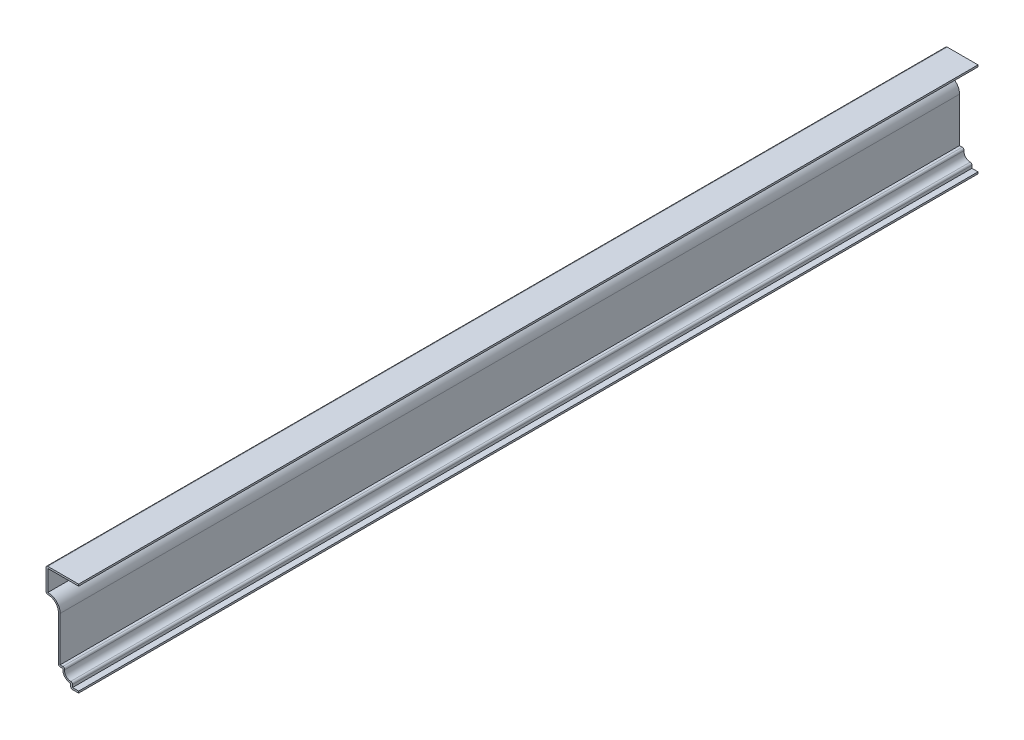
ISO-10303-21;
HEADER;
FILE_DESCRIPTION(('STEP AP214'),'2;1');
FILE_NAME('part.step','',(''),(''),'','','');
FILE_SCHEMA(('AUTOMOTIVE_DESIGN { 1 0 10303 214 1 1 1 1 }'));
ENDSEC;
DATA;
#1=APPLICATION_CONTEXT('core data for automotive mechanical design processes');
#2=APPLICATION_PROTOCOL_DEFINITION('international standard','automotive_design',2000,#1);
#3=PRODUCT_CONTEXT('',#1,'mechanical');
#4=PRODUCT('Part','Part','',(#3));
#5=PRODUCT_RELATED_PRODUCT_CATEGORY('part','',(#4));
#6=PRODUCT_DEFINITION_FORMATION('','',#4);
#7=PRODUCT_DEFINITION_CONTEXT('part definition',#1,'design');
#8=PRODUCT_DEFINITION('design','',#6,#7);
#9=PRODUCT_DEFINITION_SHAPE('','',#8);
#10=(LENGTH_UNIT() NAMED_UNIT(*) SI_UNIT(.MILLI.,.METRE.));
#11=(NAMED_UNIT(*) PLANE_ANGLE_UNIT() SI_UNIT($,.RADIAN.));
#12=(NAMED_UNIT(*) SI_UNIT($,.STERADIAN.) SOLID_ANGLE_UNIT());
#13=UNCERTAINTY_MEASURE_WITH_UNIT(LENGTH_MEASURE(1.E-05),#10,'distance_accuracy_value','');
#14=(GEOMETRIC_REPRESENTATION_CONTEXT(3) GLOBAL_UNCERTAINTY_ASSIGNED_CONTEXT((#13)) GLOBAL_UNIT_ASSIGNED_CONTEXT((#10,
#11,#12)) REPRESENTATION_CONTEXT('',''));
#15=CARTESIAN_POINT('',(0.,0.,0.));
#16=DIRECTION('',(0.,0.,1.));
#17=DIRECTION('',(1.,0.,0.));
#18=AXIS2_PLACEMENT_3D('',#15,#16,#17);
#19=CARTESIAN_POINT('',(-23.01875,65.405,-635.));
#20=DIRECTION('',(0.,-1.,0.));
#21=DIRECTION('',(0.,0.,-1.));
#22=AXIS2_PLACEMENT_3D('',#19,#20,#21);
#23=PLANE('',#22);
#24=DIRECTION('',(1.,0.,0.));
#25=VECTOR('',#24,1.);
#26=CARTESIAN_POINT('',(-23.01875,65.405,0.));
#27=LINE('',#26,#25);
#28=CARTESIAN_POINT('',(-21.74875,65.405,0.));
#29=VERTEX_POINT('',#28);
#30=CARTESIAN_POINT('',(0.,65.405,0.));
#31=VERTEX_POINT('',#30);
#32=EDGE_CURVE('E265',#29,#31,#27,.T.);
#33=ORIENTED_EDGE('',*,*,#32,.F.);
#34=DIRECTION('',(0.,0.,1.));
#35=VECTOR('',#34,1.);
#36=CARTESIAN_POINT('',(-21.74875,65.405,-635.));
#37=LINE('',#36,#35);
#38=CARTESIAN_POINT('',(-21.74875,65.405,-635.));
#39=VERTEX_POINT('',#38);
#40=EDGE_CURVE('E220',#39,#29,#37,.T.);
#41=ORIENTED_EDGE('',*,*,#40,.F.);
#42=DIRECTION('',(1.,0.,0.));
#43=VECTOR('',#42,1.);
#44=CARTESIAN_POINT('',(-23.01875,65.405,-635.));
#45=LINE('',#44,#43);
#46=CARTESIAN_POINT('',(0.,65.405,-635.));
#47=VERTEX_POINT('',#46);
#48=EDGE_CURVE('E202',#39,#47,#45,.T.);
#49=ORIENTED_EDGE('',*,*,#48,.T.);
#50=DIRECTION('',(0.,0.,1.));
#51=VECTOR('',#50,1.);
#52=CARTESIAN_POINT('',(0.,65.405,-635.));
#53=LINE('',#52,#51);
#54=EDGE_CURVE('E210',#47,#31,#53,.T.);
#55=ORIENTED_EDGE('',*,*,#54,.T.);
#56=EDGE_LOOP('',(#33,#41,#49,#55));
#57=FACE_BOUND('',#56,.T.);
#58=ADVANCED_FACE('F35',(#57),#23,.T.);
#59=CARTESIAN_POINT('',(-21.74875,49.2125,-635.));
#60=DIRECTION('',(1.,0.,0.));
#61=DIRECTION('',(0.,1.,0.));
#62=AXIS2_PLACEMENT_3D('',#59,#60,#61);
#63=PLANE('',#62);
#64=DIRECTION('',(0.,1.,0.));
#65=VECTOR('',#64,1.);
#66=CARTESIAN_POINT('',(-21.74875,49.2125,0.));
#67=LINE('',#66,#65);
#68=CARTESIAN_POINT('',(-21.74875,50.655129317317,0.));
#69=VERTEX_POINT('',#68);
#70=EDGE_CURVE('E221',#69,#29,#67,.T.);
#71=ORIENTED_EDGE('',*,*,#70,.F.);
#72=DIRECTION('',(0.,0.,1.));
#73=VECTOR('',#72,1.);
#74=CARTESIAN_POINT('',(-21.74875,50.655129317317,-635.));
#75=LINE('',#74,#73);
#76=CARTESIAN_POINT('',(-21.74875,50.655129317317,-635.));
#77=VERTEX_POINT('',#76);
#78=EDGE_CURVE('E307',#77,#69,#75,.T.);
#79=ORIENTED_EDGE('',*,*,#78,.F.);
#80=DIRECTION('',(0.,1.,0.));
#81=VECTOR('',#80,1.);
#82=CARTESIAN_POINT('',(-21.74875,49.2125,-635.));
#83=LINE('',#82,#81);
#84=EDGE_CURVE('E218',#77,#39,#83,.T.);
#85=ORIENTED_EDGE('',*,*,#84,.T.);
#86=ORIENTED_EDGE('',*,*,#40,.T.);
#87=EDGE_LOOP('',(#71,#79,#85,#86));
#88=FACE_BOUND('',#87,.T.);
#89=ADVANCED_FACE('F427',(#88),#63,.T.);
#90=CARTESIAN_POINT('',(-21.43125,42.2473720175075,-635.));
#91=DIRECTION('',(0.,0.,1.));
#92=DIRECTION('',(1.,0.,0.));
#93=AXIS2_PLACEMENT_3D('',#90,#91,#92);
#94=CYLINDRICAL_SURFACE('',#93,8.41375);
#95=CARTESIAN_POINT('',(-21.43125,42.2473720175075,0.));
#96=DIRECTION('',(0.,0.,1.));
#97=DIRECTION('',(1.,0.,0.));
#98=AXIS2_PLACEMENT_3D('',#95,#96,#97);
#99=CIRCLE('',#98,8.41375);
#100=CARTESIAN_POINT('',(-13.0175,42.2473720175075,0.));
#101=VERTEX_POINT('',#100);
#102=EDGE_CURVE('E224',#101,#69,#99,.T.);
#103=ORIENTED_EDGE('',*,*,#102,.F.);
#104=DIRECTION('',(0.,0.,1.));
#105=VECTOR('',#104,1.);
#106=CARTESIAN_POINT('',(-13.0175,42.2473720175075,-635.));
#107=LINE('',#106,#105);
#108=CARTESIAN_POINT('',(-13.0175,42.2473720175075,-635.));
#109=VERTEX_POINT('',#108);
#110=EDGE_CURVE('E309',#109,#101,#107,.T.);
#111=ORIENTED_EDGE('',*,*,#110,.F.);
#112=CARTESIAN_POINT('',(-21.43125,42.2473720175075,-635.));
#113=DIRECTION('',(0.,0.,1.));
#114=DIRECTION('',(1.,0.,0.));
#115=AXIS2_PLACEMENT_3D('',#112,#113,#114);
#116=CIRCLE('',#115,8.41375);
#117=EDGE_CURVE('E261',#109,#77,#116,.T.);
#118=ORIENTED_EDGE('',*,*,#117,.T.);
#119=ORIENTED_EDGE('',*,*,#78,.T.);
#120=EDGE_LOOP('',(#103,#111,#118,#119));
#121=FACE_BOUND('',#120,.T.);
#122=ADVANCED_FACE('F482',(#121),#94,.T.);
#123=CARTESIAN_POINT('',(-13.0175,9.525,-635.));
#124=DIRECTION('',(1.,0.,0.));
#125=DIRECTION('',(0.,1.,0.));
#126=AXIS2_PLACEMENT_3D('',#123,#124,#125);
#127=PLANE('',#126);
#128=DIRECTION('',(0.,1.,0.));
#129=VECTOR('',#128,1.);
#130=CARTESIAN_POINT('',(-13.0175,9.525,0.));
#131=LINE('',#130,#129);
#132=CARTESIAN_POINT('',(-13.0175,10.795,0.));
#133=VERTEX_POINT('',#132);
#134=EDGE_CURVE('E300',#133,#101,#131,.T.);
#135=ORIENTED_EDGE('',*,*,#134,.F.);
#136=DIRECTION('',(0.,0.,1.));
#137=VECTOR('',#136,1.);
#138=CARTESIAN_POINT('',(-13.0175,10.795,-635.));
#139=LINE('',#138,#137);
#140=CARTESIAN_POINT('',(-13.0175,10.795,-635.));
#141=VERTEX_POINT('',#140);
#142=EDGE_CURVE('E311',#141,#133,#139,.T.);
#143=ORIENTED_EDGE('',*,*,#142,.F.);
#144=DIRECTION('',(0.,1.,0.));
#145=VECTOR('',#144,1.);
#146=CARTESIAN_POINT('',(-13.0175,9.525,-635.));
#147=LINE('',#146,#145);
#148=EDGE_CURVE('E258',#141,#109,#147,.T.);
#149=ORIENTED_EDGE('',*,*,#148,.T.);
#150=ORIENTED_EDGE('',*,*,#110,.T.);
#151=EDGE_LOOP('',(#135,#143,#149,#150));
#152=FACE_BOUND('',#151,.T.);
#153=ADVANCED_FACE('F435',(#152),#127,.T.);
#154=CARTESIAN_POINT('',(-11.1125,10.795,-635.));
#155=DIRECTION('',(0.,1.,0.));
#156=DIRECTION('',(-1.,0.,0.));
#157=AXIS2_PLACEMENT_3D('',#154,#155,#156);
#158=PLANE('',#157);
#159=DIRECTION('',(-1.,0.,0.));
#160=VECTOR('',#159,1.);
#161=CARTESIAN_POINT('',(-11.1125,10.795,0.));
#162=LINE('',#161,#160);
#163=CARTESIAN_POINT('',(-11.1125,10.795,0.));
#164=VERTEX_POINT('',#163);
#165=EDGE_CURVE('E298',#164,#133,#162,.T.);
#166=ORIENTED_EDGE('',*,*,#165,.F.);
#167=DIRECTION('',(0.,0.,1.));
#168=VECTOR('',#167,1.);
#169=CARTESIAN_POINT('',(-11.1125,10.795,-635.));
#170=LINE('',#169,#168);
#171=CARTESIAN_POINT('',(-11.1125,10.795,-635.));
#172=VERTEX_POINT('',#171);
#173=EDGE_CURVE('E375',#164,#172,#170,.F.);
#174=ORIENTED_EDGE('',*,*,#173,.T.);
#175=DIRECTION('',(-1.,0.,0.));
#176=VECTOR('',#175,1.);
#177=CARTESIAN_POINT('',(-11.1125,10.795,-635.));
#178=LINE('',#177,#176);
#179=EDGE_CURVE('E256',#172,#141,#178,.T.);
#180=ORIENTED_EDGE('',*,*,#179,.T.);
#181=ORIENTED_EDGE('',*,*,#142,.T.);
#182=EDGE_LOOP('',(#166,#174,#180,#181));
#183=FACE_BOUND('',#182,.T.);
#184=ADVANCED_FACE('F438',(#183),#158,.T.);
#185=CARTESIAN_POINT('',(-5.55625,8.780859375,-635.));
#186=DIRECTION('',(0.,0.,1.));
#187=DIRECTION('',(1.,0.,0.));
#188=AXIS2_PLACEMENT_3D('',#185,#186,#187);
#189=CYLINDRICAL_SURFACE('',#188,4.335859375);
#190=CARTESIAN_POINT('',(-5.55625,8.780859375,0.));
#191=DIRECTION('',(0.,0.,1.));
#192=DIRECTION('',(1.,0.,0.));
#193=AXIS2_PLACEMENT_3D('',#190,#191,#192);
#194=CIRCLE('',#193,4.335859375);
#195=CARTESIAN_POINT('',(-5.55625,4.445,0.));
#196=VERTEX_POINT('',#195);
#197=CARTESIAN_POINT('',(-9.8537389380531,9.35641592920354,0.));
#198=VERTEX_POINT('',#197);
#199=EDGE_CURVE('E295',#196,#198,#194,.F.);
#200=ORIENTED_EDGE('',*,*,#199,.F.);
#201=DIRECTION('',(0.,0.,1.));
#202=VECTOR('',#201,1.);
#203=CARTESIAN_POINT('',(-5.55625,4.445,-635.));
#204=LINE('',#203,#202);
#205=CARTESIAN_POINT('',(-5.55625,4.445,-635.));
#206=VERTEX_POINT('',#205);
#207=EDGE_CURVE('E348',#196,#206,#204,.F.);
#208=ORIENTED_EDGE('',*,*,#207,.T.);
#209=CARTESIAN_POINT('',(-5.55625,8.780859375,-635.));
#210=DIRECTION('',(0.,0.,1.));
#211=DIRECTION('',(1.,0.,0.));
#212=AXIS2_PLACEMENT_3D('',#209,#210,#211);
#213=CIRCLE('',#212,4.335859375);
#214=CARTESIAN_POINT('',(-9.8537389380531,9.35641592920354,-635.));
#215=VERTEX_POINT('',#214);
#216=EDGE_CURVE('E253',#206,#215,#213,.F.);
#217=ORIENTED_EDGE('',*,*,#216,.T.);
#218=DIRECTION('',(0.,0.,1.));
#219=VECTOR('',#218,1.);
#220=CARTESIAN_POINT('',(-9.8537389380531,9.35641592920354,-635.));
#221=LINE('',#220,#219);
#222=EDGE_CURVE('E345',#215,#198,#221,.T.);
#223=ORIENTED_EDGE('',*,*,#222,.T.);
#224=EDGE_LOOP('',(#200,#208,#217,#223));
#225=FACE_BOUND('',#224,.T.);
#226=ADVANCED_FACE('F446',(#225),#189,.F.);
#227=CARTESIAN_POINT('',(-4.28625,0.,-635.));
#228=DIRECTION('',(1.,0.,0.));
#229=DIRECTION('',(0.,0.,-1.));
#230=AXIS2_PLACEMENT_3D('',#227,#228,#229);
#231=PLANE('',#230);
#232=DIRECTION('',(0.,1.,0.));
#233=VECTOR('',#232,1.);
#234=CARTESIAN_POINT('',(-4.28625,0.,-635.));
#235=LINE('',#234,#233);
#236=CARTESIAN_POINT('',(-4.28625,1.27,-635.));
#237=VERTEX_POINT('',#236);
#238=CARTESIAN_POINT('',(-4.28625,3.175,-635.));
#239=VERTEX_POINT('',#238);
#240=EDGE_CURVE('E250',#237,#239,#235,.T.);
#241=ORIENTED_EDGE('',*,*,#240,.T.);
#242=DIRECTION('',(0.,0.,1.));
#243=VECTOR('',#242,1.);
#244=CARTESIAN_POINT('',(-4.28625,3.175,-635.));
#245=LINE('',#244,#243);
#246=CARTESIAN_POINT('',(-4.28625,3.175,0.));
#247=VERTEX_POINT('',#246);
#248=EDGE_CURVE('E306',#239,#247,#245,.T.);
#249=ORIENTED_EDGE('',*,*,#248,.T.);
#250=DIRECTION('',(0.,1.,0.));
#251=VECTOR('',#250,1.);
#252=CARTESIAN_POINT('',(-4.28625,0.,0.));
#253=LINE('',#252,#251);
#254=CARTESIAN_POINT('',(-4.28625,1.27,0.));
#255=VERTEX_POINT('',#254);
#256=EDGE_CURVE('E292',#255,#247,#253,.T.);
#257=ORIENTED_EDGE('',*,*,#256,.F.);
#258=DIRECTION('',(0.,0.,1.));
#259=VECTOR('',#258,1.);
#260=CARTESIAN_POINT('',(-4.28625,1.27,-635.));
#261=LINE('',#260,#259);
#262=EDGE_CURVE('E314',#237,#255,#261,.T.);
#263=ORIENTED_EDGE('',*,*,#262,.F.);
#264=EDGE_LOOP('',(#241,#249,#257,#263));
#265=FACE_BOUND('',#264,.T.);
#266=ADVANCED_FACE('F454',(#265),#231,.T.);
#267=CARTESIAN_POINT('',(0.,1.27,-635.));
#268=DIRECTION('',(0.,1.,0.));
#269=DIRECTION('',(0.,0.,1.));
#270=AXIS2_PLACEMENT_3D('',#267,#268,#269);
#271=PLANE('',#270);
#272=DIRECTION('',(1.,0.,0.));
#273=VECTOR('',#272,1.);
#274=CARTESIAN_POINT('',(0.,1.27,0.));
#275=LINE('',#274,#273);
#276=CARTESIAN_POINT('',(0.,1.27,0.));
#277=VERTEX_POINT('',#276);
#278=EDGE_CURVE('E289',#277,#255,#275,.F.);
#279=ORIENTED_EDGE('',*,*,#278,.F.);
#280=DIRECTION('',(0.,0.,1.));
#281=VECTOR('',#280,1.);
#282=CARTESIAN_POINT('',(0.,1.27,-635.));
#283=LINE('',#282,#281);
#284=CARTESIAN_POINT('',(0.,1.27,-635.));
#285=VERTEX_POINT('',#284);
#286=EDGE_CURVE('E316',#285,#277,#283,.T.);
#287=ORIENTED_EDGE('',*,*,#286,.F.);
#288=DIRECTION('',(1.,0.,0.));
#289=VECTOR('',#288,1.);
#290=CARTESIAN_POINT('',(0.,1.27,-635.));
#291=LINE('',#290,#289);
#292=EDGE_CURVE('E247',#285,#237,#291,.F.);
#293=ORIENTED_EDGE('',*,*,#292,.T.);
#294=ORIENTED_EDGE('',*,*,#262,.T.);
#295=EDGE_LOOP('',(#279,#287,#293,#294));
#296=FACE_BOUND('',#295,.T.);
#297=ADVANCED_FACE('F459',(#296),#271,.T.);
#298=CARTESIAN_POINT('',(0.,1.27,-635.));
#299=DIRECTION('',(-1.,0.,0.));
#300=DIRECTION('',(0.,0.,1.));
#301=AXIS2_PLACEMENT_3D('',#298,#299,#300);
#302=PLANE('',#301);
#303=DIRECTION('',(0.,-1.,0.));
#304=VECTOR('',#303,1.);
#305=CARTESIAN_POINT('',(0.,1.27,0.));
#306=LINE('',#305,#304);
#307=CARTESIAN_POINT('',(0.,0.,0.));
#308=VERTEX_POINT('',#307);
#309=EDGE_CURVE('E287',#277,#308,#306,.T.);
#310=ORIENTED_EDGE('',*,*,#309,.T.);
#311=DIRECTION('',(0.,0.,1.));
#312=VECTOR('',#311,1.);
#313=CARTESIAN_POINT('',(0.,0.,-635.));
#314=LINE('',#313,#312);
#315=CARTESIAN_POINT('',(0.,0.,-635.));
#316=VERTEX_POINT('',#315);
#317=EDGE_CURVE('E318',#316,#308,#314,.T.);
#318=ORIENTED_EDGE('',*,*,#317,.F.);
#319=DIRECTION('',(0.,-1.,0.));
#320=VECTOR('',#319,1.);
#321=CARTESIAN_POINT('',(0.,1.27,-635.));
#322=LINE('',#321,#320);
#323=EDGE_CURVE('E245',#285,#316,#322,.T.);
#324=ORIENTED_EDGE('',*,*,#323,.F.);
#325=ORIENTED_EDGE('',*,*,#286,.T.);
#326=EDGE_LOOP('',(#310,#318,#324,#325));
#327=FACE_BOUND('',#326,.T.);
#328=ADVANCED_FACE('F464',(#327),#302,.F.);
#329=CARTESIAN_POINT('',(0.,0.,-635.));
#330=DIRECTION('',(0.,1.,0.));
#331=DIRECTION('',(0.,0.,1.));
#332=AXIS2_PLACEMENT_3D('',#329,#330,#331);
#333=PLANE('',#332);
#334=DIRECTION('',(-1.,0.,0.));
#335=VECTOR('',#334,1.);
#336=CARTESIAN_POINT('',(0.,0.,0.));
#337=LINE('',#336,#335);
#338=CARTESIAN_POINT('',(-4.28625,0.,0.));
#339=VERTEX_POINT('',#338);
#340=EDGE_CURVE('E284',#308,#339,#337,.T.);
#341=ORIENTED_EDGE('',*,*,#340,.T.);
#342=DIRECTION('',(0.,0.,1.));
#343=VECTOR('',#342,1.);
#344=CARTESIAN_POINT('',(-4.28625,0.,-635.));
#345=LINE('',#344,#343);
#346=CARTESIAN_POINT('',(-4.28625,0.,-635.));
#347=VERTEX_POINT('',#346);
#348=EDGE_CURVE('E11',#339,#347,#345,.F.);
#349=ORIENTED_EDGE('',*,*,#348,.T.);
#350=DIRECTION('',(-1.,0.,0.));
#351=VECTOR('',#350,1.);
#352=CARTESIAN_POINT('',(0.,0.,-635.));
#353=LINE('',#352,#351);
#354=EDGE_CURVE('E242',#316,#347,#353,.T.);
#355=ORIENTED_EDGE('',*,*,#354,.F.);
#356=ORIENTED_EDGE('',*,*,#317,.T.);
#357=EDGE_LOOP('',(#341,#349,#355,#356));
#358=FACE_BOUND('',#357,.T.);
#359=ADVANCED_FACE('F468',(#358),#333,.F.);
#360=CARTESIAN_POINT('',(-5.55625,0.,-635.));
#361=DIRECTION('',(1.,0.,0.));
#362=DIRECTION('',(0.,0.,-1.));
#363=AXIS2_PLACEMENT_3D('',#360,#361,#362);
#364=PLANE('',#363);
#365=DIRECTION('',(0.,1.,0.));
#366=VECTOR('',#365,1.);
#367=CARTESIAN_POINT('',(-5.55625,0.,-635.));
#368=LINE('',#367,#366);
#369=CARTESIAN_POINT('',(-5.55625,1.27,-635.));
#370=VERTEX_POINT('',#369);
#371=CARTESIAN_POINT('',(-5.55625,3.175,-635.));
#372=VERTEX_POINT('',#371);
#373=EDGE_CURVE('E240',#370,#372,#368,.T.);
#374=ORIENTED_EDGE('',*,*,#373,.F.);
#375=DIRECTION('',(0.,0.,1.));
#376=VECTOR('',#375,1.);
#377=CARTESIAN_POINT('',(-5.55625,1.27,-635.));
#378=LINE('',#377,#376);
#379=CARTESIAN_POINT('',(-5.55625,1.27,0.));
#380=VERTEX_POINT('',#379);
#381=EDGE_CURVE('E43',#370,#380,#378,.T.);
#382=ORIENTED_EDGE('',*,*,#381,.T.);
#383=DIRECTION('',(0.,1.,0.));
#384=VECTOR('',#383,1.);
#385=CARTESIAN_POINT('',(-5.55625,0.,0.));
#386=LINE('',#385,#384);
#387=CARTESIAN_POINT('',(-5.55625,3.175,0.));
#388=VERTEX_POINT('',#387);
#389=EDGE_CURVE('E282',#380,#388,#386,.T.);
#390=ORIENTED_EDGE('',*,*,#389,.T.);
#391=DIRECTION('',(0.,0.,1.));
#392=VECTOR('',#391,1.);
#393=CARTESIAN_POINT('',(-5.55625,3.175,-635.));
#394=LINE('',#393,#392);
#395=EDGE_CURVE('E321',#372,#388,#394,.T.);
#396=ORIENTED_EDGE('',*,*,#395,.F.);
#397=EDGE_LOOP('',(#374,#382,#390,#396));
#398=FACE_BOUND('',#397,.T.);
#399=ADVANCED_FACE('F381',(#398),#364,.F.);
#400=CARTESIAN_POINT('',(-5.55625,8.780859375,-635.));
#401=DIRECTION('',(0.,0.,1.));
#402=DIRECTION('',(1.,0.,0.));
#403=AXIS2_PLACEMENT_3D('',#400,#401,#402);
#404=CYLINDRICAL_SURFACE('',#403,5.605859375);
#405=CARTESIAN_POINT('',(-5.55625,8.780859375,0.));
#406=DIRECTION('',(0.,0.,-1.));
#407=DIRECTION('',(-1.,0.,0.));
#408=AXIS2_PLACEMENT_3D('',#405,#406,#407);
#409=CIRCLE('',#408,5.605859375);
#410=CARTESIAN_POINT('',(-11.1125,9.525,0.));
#411=VERTEX_POINT('',#410);
#412=EDGE_CURVE('E280',#388,#411,#409,.T.);
#413=ORIENTED_EDGE('',*,*,#412,.T.);
#414=DIRECTION('',(0.,0.,1.));
#415=VECTOR('',#414,1.);
#416=CARTESIAN_POINT('',(-11.1125,9.525,-635.));
#417=LINE('',#416,#415);
#418=CARTESIAN_POINT('',(-11.1125,9.525,-635.));
#419=VERTEX_POINT('',#418);
#420=EDGE_CURVE('E324',#419,#411,#417,.T.);
#421=ORIENTED_EDGE('',*,*,#420,.F.);
#422=CARTESIAN_POINT('',(-5.55625,8.780859375,-635.));
#423=DIRECTION('',(0.,0.,-1.));
#424=DIRECTION('',(-1.,0.,0.));
#425=AXIS2_PLACEMENT_3D('',#422,#423,#424);
#426=CIRCLE('',#425,5.605859375);
#427=EDGE_CURVE('E238',#372,#419,#426,.T.);
#428=ORIENTED_EDGE('',*,*,#427,.F.);
#429=ORIENTED_EDGE('',*,*,#395,.T.);
#430=EDGE_LOOP('',(#413,#421,#428,#429));
#431=FACE_BOUND('',#430,.T.);
#432=ADVANCED_FACE('F392',(#431),#404,.T.);
#433=CARTESIAN_POINT('',(-11.1125,9.525,-635.));
#434=DIRECTION('',(0.,1.,0.));
#435=DIRECTION('',(-1.,0.,0.));
#436=AXIS2_PLACEMENT_3D('',#433,#434,#435);
#437=PLANE('',#436);
#438=DIRECTION('',(-1.,0.,0.));
#439=VECTOR('',#438,1.);
#440=CARTESIAN_POINT('',(-11.1125,9.525,0.));
#441=LINE('',#440,#439);
#442=CARTESIAN_POINT('',(-13.0175,9.525,0.));
#443=VERTEX_POINT('',#442);
#444=EDGE_CURVE('E277',#411,#443,#441,.T.);
#445=ORIENTED_EDGE('',*,*,#444,.T.);
#446=DIRECTION('',(0.,0.,1.));
#447=VECTOR('',#446,1.);
#448=CARTESIAN_POINT('',(-13.0175,9.525,-635.));
#449=LINE('',#448,#447);
#450=CARTESIAN_POINT('',(-13.0175,9.525,-635.));
#451=VERTEX_POINT('',#450);
#452=EDGE_CURVE('E373',#443,#451,#449,.F.);
#453=ORIENTED_EDGE('',*,*,#452,.T.);
#454=DIRECTION('',(-1.,0.,0.));
#455=VECTOR('',#454,1.);
#456=CARTESIAN_POINT('',(-11.1125,9.525,-635.));
#457=LINE('',#456,#455);
#458=EDGE_CURVE('E235',#419,#451,#457,.T.);
#459=ORIENTED_EDGE('',*,*,#458,.F.);
#460=ORIENTED_EDGE('',*,*,#420,.T.);
#461=EDGE_LOOP('',(#445,#453,#459,#460));
#462=FACE_BOUND('',#461,.T.);
#463=ADVANCED_FACE('F396',(#462),#437,.F.);
#464=CARTESIAN_POINT('',(-14.2875,9.525,-635.));
#465=DIRECTION('',(1.,0.,0.));
#466=DIRECTION('',(0.,1.,0.));
#467=AXIS2_PLACEMENT_3D('',#464,#465,#466);
#468=PLANE('',#467);
#469=DIRECTION('',(0.,1.,0.));
#470=VECTOR('',#469,1.);
#471=CARTESIAN_POINT('',(-14.2875,9.525,-635.));
#472=LINE('',#471,#470);
#473=CARTESIAN_POINT('',(-14.2875,10.795,-635.));
#474=VERTEX_POINT('',#473);
#475=CARTESIAN_POINT('',(-14.2875,42.2473720175075,-635.));
#476=VERTEX_POINT('',#475);
#477=EDGE_CURVE('E233',#474,#476,#472,.T.);
#478=ORIENTED_EDGE('',*,*,#477,.F.);
#479=DIRECTION('',(0.,0.,1.));
#480=VECTOR('',#479,1.);
#481=CARTESIAN_POINT('',(-14.2875,10.795,-635.));
#482=LINE('',#481,#480);
#483=CARTESIAN_POINT('',(-14.2875,10.795,0.));
#484=VERTEX_POINT('',#483);
#485=EDGE_CURVE('E370',#474,#484,#482,.T.);
#486=ORIENTED_EDGE('',*,*,#485,.T.);
#487=DIRECTION('',(0.,1.,0.));
#488=VECTOR('',#487,1.);
#489=CARTESIAN_POINT('',(-14.2875,9.525,0.));
#490=LINE('',#489,#488);
#491=CARTESIAN_POINT('',(-14.2875,42.2473720175075,0.));
#492=VERTEX_POINT('',#491);
#493=EDGE_CURVE('E275',#484,#492,#490,.T.);
#494=ORIENTED_EDGE('',*,*,#493,.T.);
#495=DIRECTION('',(0.,0.,1.));
#496=VECTOR('',#495,1.);
#497=CARTESIAN_POINT('',(-14.2875,42.2473720175075,-635.));
#498=LINE('',#497,#496);
#499=EDGE_CURVE('E327',#476,#492,#498,.T.);
#500=ORIENTED_EDGE('',*,*,#499,.F.);
#501=EDGE_LOOP('',(#478,#486,#494,#500));
#502=FACE_BOUND('',#501,.T.);
#503=ADVANCED_FACE('F405',(#502),#468,.F.);
#504=CARTESIAN_POINT('',(-21.43125,42.2473720175075,-635.));
#505=DIRECTION('',(0.,0.,1.));
#506=DIRECTION('',(1.,0.,0.));
#507=AXIS2_PLACEMENT_3D('',#504,#505,#506);
#508=CYLINDRICAL_SURFACE('',#507,7.14375);
#509=CARTESIAN_POINT('',(-21.43125,42.2473720175075,0.));
#510=DIRECTION('',(0.,0.,1.));
#511=DIRECTION('',(1.,0.,0.));
#512=AXIS2_PLACEMENT_3D('',#509,#510,#511);
#513=CIRCLE('',#512,7.14375);
#514=CARTESIAN_POINT('',(-21.7008254716981,49.3860338758363,0.));
#515=VERTEX_POINT('',#514);
#516=EDGE_CURVE('E272',#492,#515,#513,.T.);
#517=ORIENTED_EDGE('',*,*,#516,.T.);
#518=DIRECTION('',(0.,0.,1.));
#519=VECTOR('',#518,1.);
#520=CARTESIAN_POINT('',(-21.7008254716981,49.3860338758363,-635.));
#521=LINE('',#520,#519);
#522=CARTESIAN_POINT('',(-21.7008254716981,49.3860338758363,-635.));
#523=VERTEX_POINT('',#522);
#524=EDGE_CURVE('E368',#515,#523,#521,.F.);
#525=ORIENTED_EDGE('',*,*,#524,.T.);
#526=CARTESIAN_POINT('',(-21.43125,42.2473720175075,-635.));
#527=DIRECTION('',(0.,0.,1.));
#528=DIRECTION('',(1.,0.,0.));
#529=AXIS2_PLACEMENT_3D('',#526,#527,#528);
#530=CIRCLE('',#529,7.14375);
#531=EDGE_CURVE('E230',#476,#523,#530,.T.);
#532=ORIENTED_EDGE('',*,*,#531,.F.);
#533=ORIENTED_EDGE('',*,*,#499,.T.);
#534=EDGE_LOOP('',(#517,#525,#532,#533));
#535=FACE_BOUND('',#534,.T.);
#536=ADVANCED_FACE('F411',(#535),#508,.F.);
#537=CARTESIAN_POINT('',(-23.01875,49.2125,-635.));
#538=DIRECTION('',(1.,0.,0.));
#539=DIRECTION('',(0.,1.,0.));
#540=AXIS2_PLACEMENT_3D('',#537,#538,#539);
#541=PLANE('',#540);
#542=DIRECTION('',(0.,1.,0.));
#543=VECTOR('',#542,1.);
#544=CARTESIAN_POINT('',(-23.01875,49.2125,0.));
#545=LINE('',#544,#543);
#546=CARTESIAN_POINT('',(-23.01875,50.655129317317,0.));
#547=VERTEX_POINT('',#546);
#548=CARTESIAN_POINT('',(-23.01875,65.405,0.));
#549=VERTEX_POINT('',#548);
#550=EDGE_CURVE('E270',#547,#549,#545,.T.);
#551=ORIENTED_EDGE('',*,*,#550,.T.);
#552=DIRECTION('',(0.,0.,1.));
#553=VECTOR('',#552,1.);
#554=CARTESIAN_POINT('',(-23.01875,65.405,-635.));
#555=LINE('',#554,#553);
#556=CARTESIAN_POINT('',(-23.01875,65.405,-635.));
#557=VERTEX_POINT('',#556);
#558=EDGE_CURVE('E58',#549,#557,#555,.F.);
#559=ORIENTED_EDGE('',*,*,#558,.T.);
#560=DIRECTION('',(0.,1.,0.));
#561=VECTOR('',#560,1.);
#562=CARTESIAN_POINT('',(-23.01875,49.2125,-635.));
#563=LINE('',#562,#561);
#564=CARTESIAN_POINT('',(-23.01875,50.655129317317,-635.));
#565=VERTEX_POINT('',#564);
#566=EDGE_CURVE('E228',#565,#557,#563,.T.);
#567=ORIENTED_EDGE('',*,*,#566,.F.);
#568=DIRECTION('',(0.,0.,1.));
#569=VECTOR('',#568,1.);
#570=CARTESIAN_POINT('',(-23.01875,50.655129317317,-635.));
#571=LINE('',#570,#569);
#572=EDGE_CURVE('E364',#565,#547,#571,.T.);
#573=ORIENTED_EDGE('',*,*,#572,.T.);
#574=EDGE_LOOP('',(#551,#559,#567,#573));
#575=FACE_BOUND('',#574,.T.);
#576=ADVANCED_FACE('F417',(#575),#541,.F.);
#577=CARTESIAN_POINT('',(-23.01875,66.675,-635.));
#578=DIRECTION('',(0.,-1.,0.));
#579=DIRECTION('',(0.,0.,-1.));
#580=AXIS2_PLACEMENT_3D('',#577,#578,#579);
#581=PLANE('',#580);
#582=DIRECTION('',(1.,0.,0.));
#583=VECTOR('',#582,1.);
#584=CARTESIAN_POINT('',(-23.01875,66.675,-635.));
#585=LINE('',#584,#583);
#586=CARTESIAN_POINT('',(-21.74875,66.675,-635.));
#587=VERTEX_POINT('',#586);
#588=CARTESIAN_POINT('',(0.,66.675,-635.));
#589=VERTEX_POINT('',#588);
#590=EDGE_CURVE('E204',#587,#589,#585,.T.);
#591=ORIENTED_EDGE('',*,*,#590,.F.);
#592=DIRECTION('',(0.,0.,1.));
#593=VECTOR('',#592,1.);
#594=CARTESIAN_POINT('',(-21.74875,66.675,-635.));
#595=LINE('',#594,#593);
#596=CARTESIAN_POINT('',(-21.74875,66.675,0.));
#597=VERTEX_POINT('',#596);
#598=EDGE_CURVE('E361',#587,#597,#595,.T.);
#599=ORIENTED_EDGE('',*,*,#598,.T.);
#600=DIRECTION('',(1.,0.,0.));
#601=VECTOR('',#600,1.);
#602=CARTESIAN_POINT('',(-23.01875,66.675,0.));
#603=LINE('',#602,#601);
#604=CARTESIAN_POINT('',(0.,66.675,0.));
#605=VERTEX_POINT('',#604);
#606=EDGE_CURVE('E268',#597,#605,#603,.T.);
#607=ORIENTED_EDGE('',*,*,#606,.T.);
#608=DIRECTION('',(0.,0.,1.));
#609=VECTOR('',#608,1.);
#610=CARTESIAN_POINT('',(0.,66.675,-635.));
#611=LINE('',#610,#609);
#612=EDGE_CURVE('E217',#589,#605,#611,.T.);
#613=ORIENTED_EDGE('',*,*,#612,.F.);
#614=EDGE_LOOP('',(#591,#599,#607,#613));
#615=FACE_BOUND('',#614,.T.);
#616=ADVANCED_FACE('F423',(#615),#581,.F.);
#617=CARTESIAN_POINT('',(0.,66.675,-635.));
#618=DIRECTION('',(-1.,0.,0.));
#619=DIRECTION('',(0.,0.,1.));
#620=AXIS2_PLACEMENT_3D('',#617,#618,#619);
#621=PLANE('',#620);
#622=DIRECTION('',(0.,-1.,0.));
#623=VECTOR('',#622,1.);
#624=CARTESIAN_POINT('',(0.,66.675,0.));
#625=LINE('',#624,#623);
#626=EDGE_CURVE('E213',#605,#31,#625,.T.);
#627=ORIENTED_EDGE('',*,*,#626,.T.);
#628=ORIENTED_EDGE('',*,*,#54,.F.);
#629=DIRECTION('',(0.,-1.,0.));
#630=VECTOR('',#629,1.);
#631=CARTESIAN_POINT('',(0.,66.675,-635.));
#632=LINE('',#631,#630);
#633=EDGE_CURVE('E196',#589,#47,#632,.T.);
#634=ORIENTED_EDGE('',*,*,#633,.F.);
#635=ORIENTED_EDGE('',*,*,#612,.T.);
#636=EDGE_LOOP('',(#627,#628,#634,#635));
#637=FACE_BOUND('',#636,.T.);
#638=ADVANCED_FACE('F211',(#637),#621,.F.);
#639=CARTESIAN_POINT('',(-21.43125,42.2473720175075,-635.));
#640=DIRECTION('',(0.,0.,1.));
#641=DIRECTION('',(1.,0.,0.));
#642=AXIS2_PLACEMENT_3D('',#639,#640,#641);
#643=PLANE('',#642);
#644=ORIENTED_EDGE('',*,*,#216,.F.);
#645=CARTESIAN_POINT('',(-5.55625,3.175,-635.));
#646=DIRECTION('',(0.,0.,1.));
#647=DIRECTION('',(1.,0.,0.));
#648=AXIS2_PLACEMENT_3D('',#645,#646,#647);
#649=CIRCLE('',#648,1.27);
#650=EDGE_CURVE('E359',#206,#239,#649,.F.);
#651=ORIENTED_EDGE('',*,*,#650,.T.);
#652=ORIENTED_EDGE('',*,*,#240,.F.);
#653=ORIENTED_EDGE('',*,*,#292,.F.);
#654=ORIENTED_EDGE('',*,*,#323,.T.);
#655=ORIENTED_EDGE('',*,*,#354,.T.);
#656=CARTESIAN_POINT('',(-4.28625,1.27,-635.));
#657=DIRECTION('',(0.,0.,1.));
#658=DIRECTION('',(1.,0.,0.));
#659=AXIS2_PLACEMENT_3D('',#656,#657,#658);
#660=CIRCLE('',#659,1.27);
#661=EDGE_CURVE('E350',#347,#370,#660,.F.);
#662=ORIENTED_EDGE('',*,*,#661,.T.);
#663=ORIENTED_EDGE('',*,*,#373,.T.);
#664=ORIENTED_EDGE('',*,*,#427,.T.);
#665=ORIENTED_EDGE('',*,*,#458,.T.);
#666=CARTESIAN_POINT('',(-13.0175,10.795,-635.));
#667=DIRECTION('',(0.,0.,1.));
#668=DIRECTION('',(1.,0.,0.));
#669=AXIS2_PLACEMENT_3D('',#666,#667,#668);
#670=CIRCLE('',#669,1.27);
#671=EDGE_CURVE('E354',#451,#474,#670,.F.);
#672=ORIENTED_EDGE('',*,*,#671,.T.);
#673=ORIENTED_EDGE('',*,*,#477,.T.);
#674=ORIENTED_EDGE('',*,*,#531,.T.);
#675=CARTESIAN_POINT('',(-21.74875,50.655129317317,-635.));
#676=DIRECTION('',(0.,0.,1.));
#677=DIRECTION('',(1.,0.,0.));
#678=AXIS2_PLACEMENT_3D('',#675,#676,#677);
#679=CIRCLE('',#678,1.27);
#680=EDGE_CURVE('E356',#523,#565,#679,.F.);
#681=ORIENTED_EDGE('',*,*,#680,.T.);
#682=ORIENTED_EDGE('',*,*,#566,.T.);
#683=CARTESIAN_POINT('',(-21.74875,65.405,-635.));
#684=DIRECTION('',(0.,0.,1.));
#685=DIRECTION('',(1.,0.,0.));
#686=AXIS2_PLACEMENT_3D('',#683,#684,#685);
#687=CIRCLE('',#686,1.27);
#688=EDGE_CURVE('E50',#557,#587,#687,.F.);
#689=ORIENTED_EDGE('',*,*,#688,.T.);
#690=ORIENTED_EDGE('',*,*,#590,.T.);
#691=ORIENTED_EDGE('',*,*,#633,.T.);
#692=ORIENTED_EDGE('',*,*,#48,.F.);
#693=ORIENTED_EDGE('',*,*,#84,.F.);
#694=ORIENTED_EDGE('',*,*,#117,.F.);
#695=ORIENTED_EDGE('',*,*,#148,.F.);
#696=ORIENTED_EDGE('',*,*,#179,.F.);
#697=CARTESIAN_POINT('',(-11.1125,9.525,-635.));
#698=DIRECTION('',(0.,0.,1.));
#699=DIRECTION('',(1.,0.,0.));
#700=AXIS2_PLACEMENT_3D('',#697,#698,#699);
#701=CIRCLE('',#700,1.27);
#702=EDGE_CURVE('E352',#172,#215,#701,.F.);
#703=ORIENTED_EDGE('',*,*,#702,.T.);
#704=EDGE_LOOP('',(#644,#651,#652,#653,#654,#655,#662,#663,#664,#665,#672,#673,#674,#681,#682,
#689,#690,#691,#692,#693,#694,#695,#696,#703));
#705=FACE_BOUND('',#704,.T.);
#706=ADVANCED_FACE('F199',(#705),#643,.F.);
#707=CARTESIAN_POINT('',(-21.43125,42.2473720175075,0.));
#708=DIRECTION('',(0.,0.,1.));
#709=DIRECTION('',(1.,0.,0.));
#710=AXIS2_PLACEMENT_3D('',#707,#708,#709);
#711=PLANE('',#710);
#712=ORIENTED_EDGE('',*,*,#256,.T.);
#713=CARTESIAN_POINT('',(-5.55625,3.175,0.));
#714=DIRECTION('',(0.,0.,1.));
#715=DIRECTION('',(1.,0.,0.));
#716=AXIS2_PLACEMENT_3D('',#713,#714,#715);
#717=CIRCLE('',#716,1.27);
#718=EDGE_CURVE('E343',#247,#196,#717,.T.);
#719=ORIENTED_EDGE('',*,*,#718,.T.);
#720=ORIENTED_EDGE('',*,*,#199,.T.);
#721=CARTESIAN_POINT('',(-11.1125,9.525,0.));
#722=DIRECTION('',(0.,0.,1.));
#723=DIRECTION('',(1.,0.,0.));
#724=AXIS2_PLACEMENT_3D('',#721,#722,#723);
#725=CIRCLE('',#724,1.27);
#726=EDGE_CURVE('E335',#198,#164,#725,.T.);
#727=ORIENTED_EDGE('',*,*,#726,.T.);
#728=ORIENTED_EDGE('',*,*,#165,.T.);
#729=ORIENTED_EDGE('',*,*,#134,.T.);
#730=ORIENTED_EDGE('',*,*,#102,.T.);
#731=ORIENTED_EDGE('',*,*,#70,.T.);
#732=ORIENTED_EDGE('',*,*,#32,.T.);
#733=ORIENTED_EDGE('',*,*,#626,.F.);
#734=ORIENTED_EDGE('',*,*,#606,.F.);
#735=CARTESIAN_POINT('',(-21.74875,65.405,0.));
#736=DIRECTION('',(0.,0.,1.));
#737=DIRECTION('',(1.,0.,0.));
#738=AXIS2_PLACEMENT_3D('',#735,#736,#737);
#739=CIRCLE('',#738,1.27);
#740=EDGE_CURVE('E341',#597,#549,#739,.T.);
#741=ORIENTED_EDGE('',*,*,#740,.T.);
#742=ORIENTED_EDGE('',*,*,#550,.F.);
#743=CARTESIAN_POINT('',(-21.74875,50.655129317317,0.));
#744=DIRECTION('',(0.,0.,1.));
#745=DIRECTION('',(1.,0.,0.));
#746=AXIS2_PLACEMENT_3D('',#743,#744,#745);
#747=CIRCLE('',#746,1.27);
#748=EDGE_CURVE('E339',#547,#515,#747,.T.);
#749=ORIENTED_EDGE('',*,*,#748,.T.);
#750=ORIENTED_EDGE('',*,*,#516,.F.);
#751=ORIENTED_EDGE('',*,*,#493,.F.);
#752=CARTESIAN_POINT('',(-13.0175,10.795,0.));
#753=DIRECTION('',(0.,0.,1.));
#754=DIRECTION('',(1.,0.,0.));
#755=AXIS2_PLACEMENT_3D('',#752,#753,#754);
#756=CIRCLE('',#755,1.27);
#757=EDGE_CURVE('E337',#484,#443,#756,.T.);
#758=ORIENTED_EDGE('',*,*,#757,.T.);
#759=ORIENTED_EDGE('',*,*,#444,.F.);
#760=ORIENTED_EDGE('',*,*,#412,.F.);
#761=ORIENTED_EDGE('',*,*,#389,.F.);
#762=CARTESIAN_POINT('',(-4.28625,1.27,0.));
#763=DIRECTION('',(0.,0.,1.));
#764=DIRECTION('',(1.,0.,0.));
#765=AXIS2_PLACEMENT_3D('',#762,#763,#764);
#766=CIRCLE('',#765,1.27);
#767=EDGE_CURVE('E333',#380,#339,#766,.T.);
#768=ORIENTED_EDGE('',*,*,#767,.T.);
#769=ORIENTED_EDGE('',*,*,#340,.F.);
#770=ORIENTED_EDGE('',*,*,#309,.F.);
#771=ORIENTED_EDGE('',*,*,#278,.T.);
#772=EDGE_LOOP('',(#712,#719,#720,#727,#728,#729,#730,#731,#732,#733,#734,#741,#742,#749,#750,
#751,#758,#759,#760,#761,#768,#769,#770,#771));
#773=FACE_BOUND('',#772,.T.);
#774=ADVANCED_FACE('F387',(#773),#711,.T.);
#775=CARTESIAN_POINT('',(-5.55625,3.175,-635.));
#776=DIRECTION('',(0.,0.,1.));
#777=DIRECTION('',(1.,0.,0.));
#778=AXIS2_PLACEMENT_3D('',#775,#776,#777);
#779=CYLINDRICAL_SURFACE('',#778,1.27);
#780=ORIENTED_EDGE('',*,*,#650,.F.);
#781=ORIENTED_EDGE('',*,*,#207,.F.);
#782=ORIENTED_EDGE('',*,*,#718,.F.);
#783=ORIENTED_EDGE('',*,*,#248,.F.);
#784=EDGE_LOOP('',(#780,#781,#782,#783));
#785=FACE_BOUND('',#784,.T.);
#786=ADVANCED_FACE('F452',(#785),#779,.T.);
#787=CARTESIAN_POINT('',(-21.74875,65.405,-635.));
#788=DIRECTION('',(0.,0.,1.));
#789=DIRECTION('',(1.,0.,0.));
#790=AXIS2_PLACEMENT_3D('',#787,#788,#789);
#791=CYLINDRICAL_SURFACE('',#790,1.27);
#792=ORIENTED_EDGE('',*,*,#688,.F.);
#793=ORIENTED_EDGE('',*,*,#558,.F.);
#794=ORIENTED_EDGE('',*,*,#740,.F.);
#795=ORIENTED_EDGE('',*,*,#598,.F.);
#796=EDGE_LOOP('',(#792,#793,#794,#795));
#797=FACE_BOUND('',#796,.T.);
#798=ADVANCED_FACE('F421',(#797),#791,.T.);
#799=CARTESIAN_POINT('',(-21.74875,50.655129317317,-635.));
#800=DIRECTION('',(0.,0.,1.));
#801=DIRECTION('',(1.,0.,0.));
#802=AXIS2_PLACEMENT_3D('',#799,#800,#801);
#803=CYLINDRICAL_SURFACE('',#802,1.27);
#804=ORIENTED_EDGE('',*,*,#680,.F.);
#805=ORIENTED_EDGE('',*,*,#524,.F.);
#806=ORIENTED_EDGE('',*,*,#748,.F.);
#807=ORIENTED_EDGE('',*,*,#572,.F.);
#808=EDGE_LOOP('',(#804,#805,#806,#807));
#809=FACE_BOUND('',#808,.T.);
#810=ADVANCED_FACE('F415',(#809),#803,.T.);
#811=CARTESIAN_POINT('',(-13.0175,10.795,-635.));
#812=DIRECTION('',(0.,0.,1.));
#813=DIRECTION('',(1.,0.,0.));
#814=AXIS2_PLACEMENT_3D('',#811,#812,#813);
#815=CYLINDRICAL_SURFACE('',#814,1.27);
#816=ORIENTED_EDGE('',*,*,#671,.F.);
#817=ORIENTED_EDGE('',*,*,#452,.F.);
#818=ORIENTED_EDGE('',*,*,#757,.F.);
#819=ORIENTED_EDGE('',*,*,#485,.F.);
#820=EDGE_LOOP('',(#816,#817,#818,#819));
#821=FACE_BOUND('',#820,.T.);
#822=ADVANCED_FACE('F402',(#821),#815,.T.);
#823=CARTESIAN_POINT('',(-11.1125,9.525,-635.));
#824=DIRECTION('',(0.,0.,1.));
#825=DIRECTION('',(1.,0.,0.));
#826=AXIS2_PLACEMENT_3D('',#823,#824,#825);
#827=CYLINDRICAL_SURFACE('',#826,1.27);
#828=ORIENTED_EDGE('',*,*,#702,.F.);
#829=ORIENTED_EDGE('',*,*,#173,.F.);
#830=ORIENTED_EDGE('',*,*,#726,.F.);
#831=ORIENTED_EDGE('',*,*,#222,.F.);
#832=EDGE_LOOP('',(#828,#829,#830,#831));
#833=FACE_BOUND('',#832,.T.);
#834=ADVANCED_FACE('F443',(#833),#827,.T.);
#835=CARTESIAN_POINT('',(-4.28625,1.27,-635.));
#836=DIRECTION('',(0.,0.,1.));
#837=DIRECTION('',(1.,0.,0.));
#838=AXIS2_PLACEMENT_3D('',#835,#836,#837);
#839=CYLINDRICAL_SURFACE('',#838,1.27);
#840=ORIENTED_EDGE('',*,*,#661,.F.);
#841=ORIENTED_EDGE('',*,*,#348,.F.);
#842=ORIENTED_EDGE('',*,*,#767,.F.);
#843=ORIENTED_EDGE('',*,*,#381,.F.);
#844=EDGE_LOOP('',(#840,#841,#842,#843));
#845=FACE_BOUND('',#844,.T.);
#846=ADVANCED_FACE('F37',(#845),#839,.T.);
#847=CLOSED_SHELL('',(#58,#89,#122,#153,#184,#226,#266,#297,#328,#359,#399,#432,#463,#503,#536,
#576,#616,#638,#706,#774,#786,#798,#810,#822,#834,#846));
#848=MANIFOLD_SOLID_BREP('B2',#847);
#849=ADVANCED_BREP_SHAPE_REPRESENTATION('',(#18,#848),#14);
#850=SHAPE_DEFINITION_REPRESENTATION(#9,#849);
ENDSEC;
END-ISO-10303-21;
